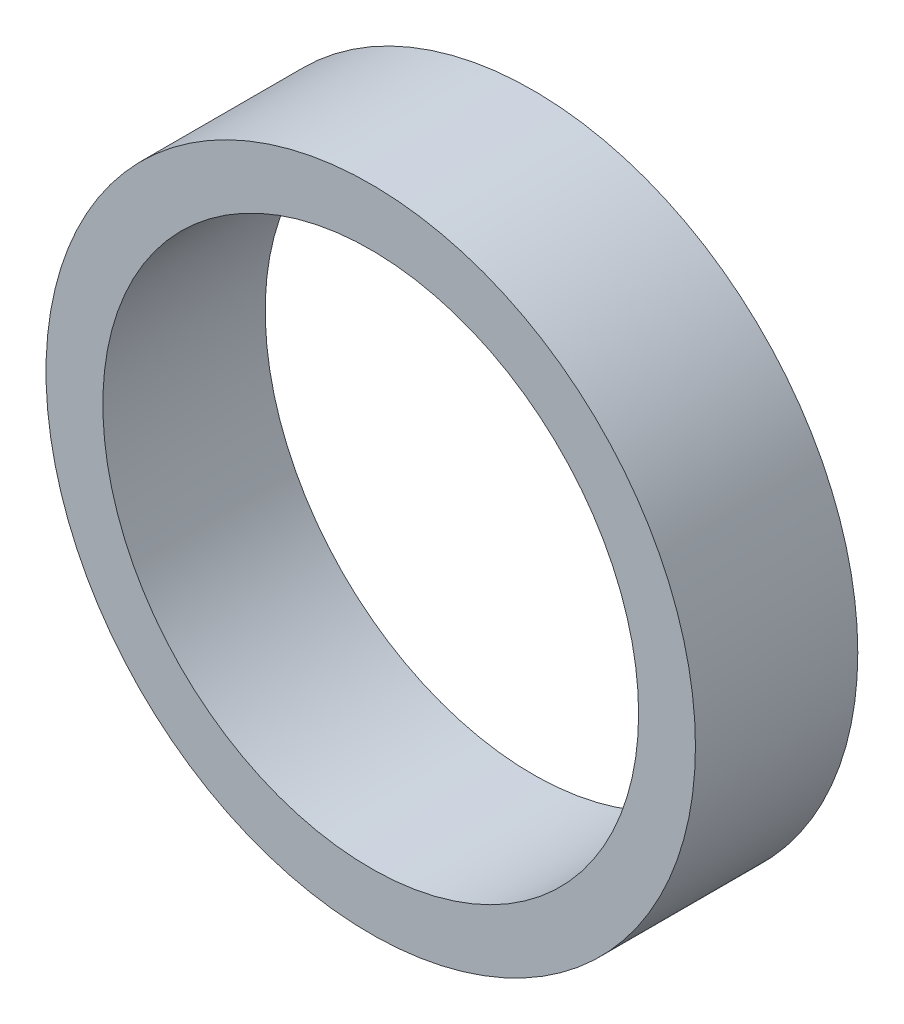
ISO-10303-21;
HEADER;
FILE_DESCRIPTION(('STEP AP214'),'2;1');
FILE_NAME('part.step','',(''),(''),'','','');
FILE_SCHEMA(('AUTOMOTIVE_DESIGN { 1 0 10303 214 1 1 1 1 }'));
ENDSEC;
DATA;
#1=APPLICATION_CONTEXT('core data for automotive mechanical design processes');
#2=APPLICATION_PROTOCOL_DEFINITION('international standard','automotive_design',2000,#1);
#3=PRODUCT_CONTEXT('',#1,'mechanical');
#4=PRODUCT('Part','Part','',(#3));
#5=PRODUCT_RELATED_PRODUCT_CATEGORY('part','',(#4));
#6=PRODUCT_DEFINITION_FORMATION('','',#4);
#7=PRODUCT_DEFINITION_CONTEXT('part definition',#1,'design');
#8=PRODUCT_DEFINITION('design','',#6,#7);
#9=PRODUCT_DEFINITION_SHAPE('','',#8);
#10=(LENGTH_UNIT() NAMED_UNIT(*) SI_UNIT(.MILLI.,.METRE.));
#11=(NAMED_UNIT(*) PLANE_ANGLE_UNIT() SI_UNIT($,.RADIAN.));
#12=(NAMED_UNIT(*) SI_UNIT($,.STERADIAN.) SOLID_ANGLE_UNIT());
#13=UNCERTAINTY_MEASURE_WITH_UNIT(LENGTH_MEASURE(1.E-05),#10,'distance_accuracy_value','');
#14=(GEOMETRIC_REPRESENTATION_CONTEXT(3) GLOBAL_UNCERTAINTY_ASSIGNED_CONTEXT((#13)) GLOBAL_UNIT_ASSIGNED_CONTEXT((#10,
#11,#12)) REPRESENTATION_CONTEXT('',''));
#15=CARTESIAN_POINT('',(0.,0.,0.));
#16=DIRECTION('',(0.,0.,1.));
#17=DIRECTION('',(1.,0.,0.));
#18=AXIS2_PLACEMENT_3D('',#15,#16,#17);
#19=CARTESIAN_POINT('',(0.,0.,-20.));
#20=DIRECTION('',(0.,0.,1.));
#21=DIRECTION('',(1.,0.,0.));
#22=AXIS2_PLACEMENT_3D('',#19,#20,#21);
#23=CYLINDRICAL_SURFACE('',#22,40.);
#24=CARTESIAN_POINT('',(0.,0.,-20.));
#25=DIRECTION('',(0.,0.,1.));
#26=DIRECTION('',(1.,0.,0.));
#27=AXIS2_PLACEMENT_3D('',#24,#25,#26);
#28=CIRCLE('',#27,40.);
#29=CARTESIAN_POINT('',(40.,0.,-20.));
#30=VERTEX_POINT('',#29);
#31=EDGE_CURVE('E10',#30,#30,#28,.T.);
#32=ORIENTED_EDGE('',*,*,#31,.T.);
#33=EDGE_LOOP('',(#32));
#34=FACE_BOUND('',#33,.T.);
#35=CARTESIAN_POINT('',(0.,0.,0.));
#36=DIRECTION('',(0.,0.,1.));
#37=DIRECTION('',(1.,0.,0.));
#38=AXIS2_PLACEMENT_3D('',#35,#36,#37);
#39=CIRCLE('',#38,40.);
#40=CARTESIAN_POINT('',(40.,0.,0.));
#41=VERTEX_POINT('',#40);
#42=EDGE_CURVE('E35',#41,#41,#39,.T.);
#43=ORIENTED_EDGE('',*,*,#42,.F.);
#44=EDGE_LOOP('',(#43));
#45=FACE_BOUND('',#44,.T.);
#46=ADVANCED_FACE('F32',(#34,#45),#23,.T.);
#47=CARTESIAN_POINT('',(0.,0.,-20.));
#48=DIRECTION('',(0.,0.,1.));
#49=DIRECTION('',(1.,0.,0.));
#50=AXIS2_PLACEMENT_3D('',#47,#48,#49);
#51=PLANE('',#50);
#52=CARTESIAN_POINT('',(0.,0.,-20.));
#53=DIRECTION('',(0.,0.,1.));
#54=DIRECTION('',(1.,0.,0.));
#55=AXIS2_PLACEMENT_3D('',#52,#53,#54);
#56=CIRCLE('',#55,33.);
#57=CARTESIAN_POINT('',(33.,0.,-20.));
#58=VERTEX_POINT('',#57);
#59=EDGE_CURVE('E42',#58,#58,#56,.T.);
#60=ORIENTED_EDGE('',*,*,#59,.T.);
#61=EDGE_LOOP('',(#60));
#62=FACE_BOUND('',#61,.T.);
#63=ORIENTED_EDGE('',*,*,#31,.F.);
#64=EDGE_LOOP('',(#63));
#65=FACE_BOUND('',#64,.T.);
#66=ADVANCED_FACE('F50',(#62,#65),#51,.F.);
#67=CARTESIAN_POINT('',(0.,0.,0.));
#68=DIRECTION('',(0.,0.,1.));
#69=DIRECTION('',(1.,0.,0.));
#70=AXIS2_PLACEMENT_3D('',#67,#68,#69);
#71=PLANE('',#70);
#72=CARTESIAN_POINT('',(0.,0.,0.));
#73=DIRECTION('',(0.,0.,1.));
#74=DIRECTION('',(1.,0.,0.));
#75=AXIS2_PLACEMENT_3D('',#72,#73,#74);
#76=CIRCLE('',#75,33.);
#77=CARTESIAN_POINT('',(33.,0.,0.));
#78=VERTEX_POINT('',#77);
#79=EDGE_CURVE('E44',#78,#78,#76,.T.);
#80=ORIENTED_EDGE('',*,*,#79,.F.);
#81=EDGE_LOOP('',(#80));
#82=FACE_BOUND('',#81,.T.);
#83=ORIENTED_EDGE('',*,*,#42,.T.);
#84=EDGE_LOOP('',(#83));
#85=FACE_BOUND('',#84,.T.);
#86=ADVANCED_FACE('F56',(#82,#85),#71,.T.);
#87=CARTESIAN_POINT('',(0.,0.,-20.));
#88=DIRECTION('',(0.,0.,1.));
#89=DIRECTION('',(1.,0.,0.));
#90=AXIS2_PLACEMENT_3D('',#87,#88,#89);
#91=CYLINDRICAL_SURFACE('',#90,33.);
#92=ORIENTED_EDGE('',*,*,#59,.F.);
#93=EDGE_LOOP('',(#92));
#94=FACE_BOUND('',#93,.T.);
#95=ORIENTED_EDGE('',*,*,#79,.T.);
#96=EDGE_LOOP('',(#95));
#97=FACE_BOUND('',#96,.T.);
#98=ADVANCED_FACE('F53',(#94,#97),#91,.F.);
#99=CLOSED_SHELL('',(#46,#66,#86,#98));
#100=MANIFOLD_SOLID_BREP('B2',#99);
#101=ADVANCED_BREP_SHAPE_REPRESENTATION('',(#18,#100),#14);
#102=SHAPE_DEFINITION_REPRESENTATION(#9,#101);
ENDSEC;
END-ISO-10303-21;
